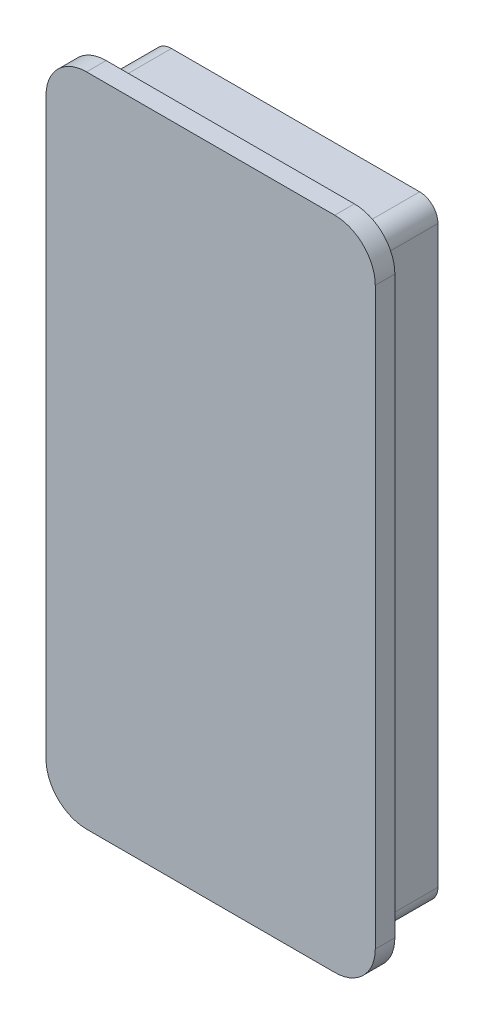
ISO-10303-21;
HEADER;
FILE_DESCRIPTION(('STEP AP214'),'2;1');
FILE_NAME('part.step','',(''),(''),'','','');
FILE_SCHEMA(('AUTOMOTIVE_DESIGN { 1 0 10303 214 1 1 1 1 }'));
ENDSEC;
DATA;
#1=APPLICATION_CONTEXT('core data for automotive mechanical design processes');
#2=APPLICATION_PROTOCOL_DEFINITION('international standard','automotive_design',2000,#1);
#3=PRODUCT_CONTEXT('',#1,'mechanical');
#4=PRODUCT('Part','Part','',(#3));
#5=PRODUCT_RELATED_PRODUCT_CATEGORY('part','',(#4));
#6=PRODUCT_DEFINITION_FORMATION('','',#4);
#7=PRODUCT_DEFINITION_CONTEXT('part definition',#1,'design');
#8=PRODUCT_DEFINITION('design','',#6,#7);
#9=PRODUCT_DEFINITION_SHAPE('','',#8);
#10=(LENGTH_UNIT() NAMED_UNIT(*) SI_UNIT(.MILLI.,.METRE.));
#11=(NAMED_UNIT(*) PLANE_ANGLE_UNIT() SI_UNIT($,.RADIAN.));
#12=(NAMED_UNIT(*) SI_UNIT($,.STERADIAN.) SOLID_ANGLE_UNIT());
#13=UNCERTAINTY_MEASURE_WITH_UNIT(LENGTH_MEASURE(1.E-05),#10,'distance_accuracy_value','');
#14=(GEOMETRIC_REPRESENTATION_CONTEXT(3) GLOBAL_UNCERTAINTY_ASSIGNED_CONTEXT((#13)) GLOBAL_UNIT_ASSIGNED_CONTEXT((#10,
#11,#12)) REPRESENTATION_CONTEXT('',''));
#15=CARTESIAN_POINT('',(0.,0.,0.));
#16=DIRECTION('',(0.,0.,1.));
#17=DIRECTION('',(1.,0.,0.));
#18=AXIS2_PLACEMENT_3D('',#15,#16,#17);
#19=CARTESIAN_POINT('',(-10.9,0.,405.1));
#20=DIRECTION('',(-1.,0.,0.));
#21=DIRECTION('',(0.,0.,1.));
#22=AXIS2_PLACEMENT_3D('',#19,#20,#21);
#23=PLANE('',#22);
#24=DIRECTION('',(0.,-1.,0.));
#25=VECTOR('',#24,1.);
#26=CARTESIAN_POINT('',(-10.9,0.,410.1));
#27=LINE('',#26,#25);
#28=CARTESIAN_POINT('',(-10.9,-3.,410.1));
#29=VERTEX_POINT('',#28);
#30=CARTESIAN_POINT('',(-10.9,-47.,410.1));
#31=VERTEX_POINT('',#30);
#32=EDGE_CURVE('E176',#29,#31,#27,.T.);
#33=ORIENTED_EDGE('',*,*,#32,.F.);
#34=DIRECTION('',(0.,0.,1.));
#35=VECTOR('',#34,1.);
#36=CARTESIAN_POINT('',(-10.9,-3.,405.1));
#37=LINE('',#36,#35);
#38=CARTESIAN_POINT('',(-10.9,-3.,405.1));
#39=VERTEX_POINT('',#38);
#40=EDGE_CURVE('E13',#39,#29,#37,.T.);
#41=ORIENTED_EDGE('',*,*,#40,.F.);
#42=DIRECTION('',(0.,-1.,0.));
#43=VECTOR('',#42,1.);
#44=CARTESIAN_POINT('',(-10.9,0.,405.1));
#45=LINE('',#44,#43);
#46=CARTESIAN_POINT('',(-10.9,-47.,405.1));
#47=VERTEX_POINT('',#46);
#48=EDGE_CURVE('E316',#39,#47,#45,.T.);
#49=ORIENTED_EDGE('',*,*,#48,.T.);
#50=DIRECTION('',(0.,0.,1.));
#51=VECTOR('',#50,1.);
#52=CARTESIAN_POINT('',(-10.9,-47.,405.1));
#53=LINE('',#52,#51);
#54=EDGE_CURVE('E206',#47,#31,#53,.T.);
#55=ORIENTED_EDGE('',*,*,#54,.T.);
#56=EDGE_LOOP('',(#33,#41,#49,#55));
#57=FACE_BOUND('',#56,.T.);
#58=ADVANCED_FACE('F49',(#57),#23,.T.);
#59=CARTESIAN_POINT('',(-9.5,-3.,405.1));
#60=DIRECTION('',(0.,0.,1.));
#61=DIRECTION('',(1.,0.,0.));
#62=AXIS2_PLACEMENT_3D('',#59,#60,#61);
#63=CYLINDRICAL_SURFACE('',#62,1.4);
#64=CARTESIAN_POINT('',(-9.5,-3.,410.1));
#65=DIRECTION('',(0.,0.,1.));
#66=DIRECTION('',(1.,0.,0.));
#67=AXIS2_PLACEMENT_3D('',#64,#65,#66);
#68=CIRCLE('',#67,1.4);
#69=CARTESIAN_POINT('',(-9.5,-1.6,410.1));
#70=VERTEX_POINT('',#69);
#71=EDGE_CURVE('E194',#70,#29,#68,.T.);
#72=ORIENTED_EDGE('',*,*,#71,.F.);
#73=DIRECTION('',(0.,0.,1.));
#74=VECTOR('',#73,1.);
#75=CARTESIAN_POINT('',(-9.5,-1.6,405.1));
#76=LINE('',#75,#74);
#77=CARTESIAN_POINT('',(-9.5,-1.6,405.1));
#78=VERTEX_POINT('',#77);
#79=EDGE_CURVE('E59',#78,#70,#76,.T.);
#80=ORIENTED_EDGE('',*,*,#79,.F.);
#81=CARTESIAN_POINT('',(-9.5,-3.,405.1));
#82=DIRECTION('',(0.,0.,1.));
#83=DIRECTION('',(1.,0.,0.));
#84=AXIS2_PLACEMENT_3D('',#81,#82,#83);
#85=CIRCLE('',#84,1.4);
#86=EDGE_CURVE('E153',#78,#39,#85,.T.);
#87=ORIENTED_EDGE('',*,*,#86,.T.);
#88=ORIENTED_EDGE('',*,*,#40,.T.);
#89=EDGE_LOOP('',(#72,#80,#87,#88));
#90=FACE_BOUND('',#89,.T.);
#91=ADVANCED_FACE('F339',(#90),#63,.T.);
#92=CARTESIAN_POINT('',(0.,-1.6,405.1));
#93=DIRECTION('',(0.,1.,0.));
#94=DIRECTION('',(-1.,0.,0.));
#95=AXIS2_PLACEMENT_3D('',#92,#93,#94);
#96=PLANE('',#95);
#97=DIRECTION('',(-1.,0.,0.));
#98=VECTOR('',#97,1.);
#99=CARTESIAN_POINT('',(0.,-1.6,410.1));
#100=LINE('',#99,#98);
#101=CARTESIAN_POINT('',(9.5,-1.6,410.1));
#102=VERTEX_POINT('',#101);
#103=EDGE_CURVE('E142',#102,#70,#100,.T.);
#104=ORIENTED_EDGE('',*,*,#103,.F.);
#105=DIRECTION('',(0.,0.,1.));
#106=VECTOR('',#105,1.);
#107=CARTESIAN_POINT('',(9.5,-1.6,405.1));
#108=LINE('',#107,#106);
#109=CARTESIAN_POINT('',(9.5,-1.6,405.1));
#110=VERTEX_POINT('',#109);
#111=EDGE_CURVE('E97',#110,#102,#108,.T.);
#112=ORIENTED_EDGE('',*,*,#111,.F.);
#113=DIRECTION('',(-1.,0.,0.));
#114=VECTOR('',#113,1.);
#115=CARTESIAN_POINT('',(0.,-1.6,405.1));
#116=LINE('',#115,#114);
#117=EDGE_CURVE('E139',#110,#78,#116,.T.);
#118=ORIENTED_EDGE('',*,*,#117,.T.);
#119=ORIENTED_EDGE('',*,*,#79,.T.);
#120=EDGE_LOOP('',(#104,#112,#118,#119));
#121=FACE_BOUND('',#120,.T.);
#122=ADVANCED_FACE('F138',(#121),#96,.T.);
#123=CARTESIAN_POINT('',(9.5,-3.,405.1));
#124=DIRECTION('',(0.,0.,1.));
#125=DIRECTION('',(1.,0.,0.));
#126=AXIS2_PLACEMENT_3D('',#123,#124,#125);
#127=CYLINDRICAL_SURFACE('',#126,1.4);
#128=CARTESIAN_POINT('',(9.5,-3.,410.1));
#129=DIRECTION('',(0.,0.,1.));
#130=DIRECTION('',(1.,0.,0.));
#131=AXIS2_PLACEMENT_3D('',#128,#129,#130);
#132=CIRCLE('',#131,1.4);
#133=CARTESIAN_POINT('',(10.9,-3.,410.1));
#134=VERTEX_POINT('',#133);
#135=EDGE_CURVE('E191',#134,#102,#132,.T.);
#136=ORIENTED_EDGE('',*,*,#135,.F.);
#137=DIRECTION('',(0.,0.,1.));
#138=VECTOR('',#137,1.);
#139=CARTESIAN_POINT('',(10.9,-3.,405.1));
#140=LINE('',#139,#138);
#141=CARTESIAN_POINT('',(10.9,-3.,405.1));
#142=VERTEX_POINT('',#141);
#143=EDGE_CURVE('E144',#142,#134,#140,.T.);
#144=ORIENTED_EDGE('',*,*,#143,.F.);
#145=CARTESIAN_POINT('',(9.5,-3.,405.1));
#146=DIRECTION('',(0.,0.,1.));
#147=DIRECTION('',(1.,0.,0.));
#148=AXIS2_PLACEMENT_3D('',#145,#146,#147);
#149=CIRCLE('',#148,1.4);
#150=EDGE_CURVE('E150',#142,#110,#149,.T.);
#151=ORIENTED_EDGE('',*,*,#150,.T.);
#152=ORIENTED_EDGE('',*,*,#111,.T.);
#153=EDGE_LOOP('',(#136,#144,#151,#152));
#154=FACE_BOUND('',#153,.T.);
#155=ADVANCED_FACE('F155',(#154),#127,.T.);
#156=CARTESIAN_POINT('',(10.9,0.,405.1));
#157=DIRECTION('',(1.,0.,0.));
#158=DIRECTION('',(0.,0.,-1.));
#159=AXIS2_PLACEMENT_3D('',#156,#157,#158);
#160=PLANE('',#159);
#161=DIRECTION('',(0.,1.,0.));
#162=VECTOR('',#161,1.);
#163=CARTESIAN_POINT('',(10.9,0.,410.1));
#164=LINE('',#163,#162);
#165=CARTESIAN_POINT('',(10.9,-47.,410.1));
#166=VERTEX_POINT('',#165);
#167=EDGE_CURVE('E188',#166,#134,#164,.T.);
#168=ORIENTED_EDGE('',*,*,#167,.F.);
#169=DIRECTION('',(0.,0.,1.));
#170=VECTOR('',#169,1.);
#171=CARTESIAN_POINT('',(10.9,-47.,405.1));
#172=LINE('',#171,#170);
#173=CARTESIAN_POINT('',(10.9,-47.,405.1));
#174=VERTEX_POINT('',#173);
#175=EDGE_CURVE('E200',#174,#166,#172,.T.);
#176=ORIENTED_EDGE('',*,*,#175,.F.);
#177=DIRECTION('',(0.,1.,0.));
#178=VECTOR('',#177,1.);
#179=CARTESIAN_POINT('',(10.9,0.,405.1));
#180=LINE('',#179,#178);
#181=EDGE_CURVE('E156',#174,#142,#180,.T.);
#182=ORIENTED_EDGE('',*,*,#181,.T.);
#183=ORIENTED_EDGE('',*,*,#143,.T.);
#184=EDGE_LOOP('',(#168,#176,#182,#183));
#185=FACE_BOUND('',#184,.T.);
#186=ADVANCED_FACE('F343',(#185),#160,.T.);
#187=CARTESIAN_POINT('',(9.5,-47.,405.1));
#188=DIRECTION('',(0.,0.,1.));
#189=DIRECTION('',(1.,0.,0.));
#190=AXIS2_PLACEMENT_3D('',#187,#188,#189);
#191=CYLINDRICAL_SURFACE('',#190,1.4);
#192=CARTESIAN_POINT('',(9.5,-47.,410.1));
#193=DIRECTION('',(0.,0.,1.));
#194=DIRECTION('',(1.,0.,0.));
#195=AXIS2_PLACEMENT_3D('',#192,#193,#194);
#196=CIRCLE('',#195,1.4);
#197=CARTESIAN_POINT('',(9.5,-48.4,410.1));
#198=VERTEX_POINT('',#197);
#199=EDGE_CURVE('E185',#198,#166,#196,.T.);
#200=ORIENTED_EDGE('',*,*,#199,.F.);
#201=DIRECTION('',(0.,0.,1.));
#202=VECTOR('',#201,1.);
#203=CARTESIAN_POINT('',(9.5,-48.4,405.1));
#204=LINE('',#203,#202);
#205=CARTESIAN_POINT('',(9.5,-48.4,405.1));
#206=VERTEX_POINT('',#205);
#207=EDGE_CURVE('E202',#206,#198,#204,.T.);
#208=ORIENTED_EDGE('',*,*,#207,.F.);
#209=CARTESIAN_POINT('',(9.5,-47.,405.1));
#210=DIRECTION('',(0.,0.,1.));
#211=DIRECTION('',(1.,0.,0.));
#212=AXIS2_PLACEMENT_3D('',#209,#210,#211);
#213=CIRCLE('',#212,1.4);
#214=EDGE_CURVE('E158',#206,#174,#213,.T.);
#215=ORIENTED_EDGE('',*,*,#214,.T.);
#216=ORIENTED_EDGE('',*,*,#175,.T.);
#217=EDGE_LOOP('',(#200,#208,#215,#216));
#218=FACE_BOUND('',#217,.T.);
#219=ADVANCED_FACE('F327',(#218),#191,.T.);
#220=CARTESIAN_POINT('',(0.,-48.4,405.1));
#221=DIRECTION('',(0.,-1.,0.));
#222=DIRECTION('',(0.,0.,-1.));
#223=AXIS2_PLACEMENT_3D('',#220,#221,#222);
#224=PLANE('',#223);
#225=DIRECTION('',(1.,0.,0.));
#226=VECTOR('',#225,1.);
#227=CARTESIAN_POINT('',(0.,-48.4,410.1));
#228=LINE('',#227,#226);
#229=CARTESIAN_POINT('',(-9.5,-48.4,410.1));
#230=VERTEX_POINT('',#229);
#231=EDGE_CURVE('E182',#230,#198,#228,.T.);
#232=ORIENTED_EDGE('',*,*,#231,.F.);
#233=DIRECTION('',(0.,0.,1.));
#234=VECTOR('',#233,1.);
#235=CARTESIAN_POINT('',(-9.5,-48.4,405.1));
#236=LINE('',#235,#234);
#237=CARTESIAN_POINT('',(-9.5,-48.4,405.1));
#238=VERTEX_POINT('',#237);
#239=EDGE_CURVE('E204',#238,#230,#236,.T.);
#240=ORIENTED_EDGE('',*,*,#239,.F.);
#241=DIRECTION('',(1.,0.,0.));
#242=VECTOR('',#241,1.);
#243=CARTESIAN_POINT('',(0.,-48.4,405.1));
#244=LINE('',#243,#242);
#245=EDGE_CURVE('E321',#238,#206,#244,.T.);
#246=ORIENTED_EDGE('',*,*,#245,.T.);
#247=ORIENTED_EDGE('',*,*,#207,.T.);
#248=EDGE_LOOP('',(#232,#240,#246,#247));
#249=FACE_BOUND('',#248,.T.);
#250=ADVANCED_FACE('F333',(#249),#224,.T.);
#251=CARTESIAN_POINT('',(0.,-3.1,405.1));
#252=DIRECTION('',(0.,-1.,0.));
#253=DIRECTION('',(0.,0.,-1.));
#254=AXIS2_PLACEMENT_3D('',#251,#252,#253);
#255=PLANE('',#254);
#256=DIRECTION('',(1.,0.,0.));
#257=VECTOR('',#256,1.);
#258=CARTESIAN_POINT('',(0.,-3.1,410.1));
#259=LINE('',#258,#257);
#260=CARTESIAN_POINT('',(-9.4,-3.1,410.1));
#261=VERTEX_POINT('',#260);
#262=CARTESIAN_POINT('',(9.39999999999999,-3.1,410.1));
#263=VERTEX_POINT('',#262);
#264=EDGE_CURVE('E163',#261,#263,#259,.T.);
#265=ORIENTED_EDGE('',*,*,#264,.F.);
#266=DIRECTION('',(0.,0.,1.));
#267=VECTOR('',#266,1.);
#268=CARTESIAN_POINT('',(-9.4,-3.1,405.1));
#269=LINE('',#268,#267);
#270=CARTESIAN_POINT('',(-9.4,-3.1,405.1));
#271=VERTEX_POINT('',#270);
#272=EDGE_CURVE('E208',#271,#261,#269,.T.);
#273=ORIENTED_EDGE('',*,*,#272,.F.);
#274=DIRECTION('',(1.,0.,0.));
#275=VECTOR('',#274,1.);
#276=CARTESIAN_POINT('',(0.,-3.1,405.1));
#277=LINE('',#276,#275);
#278=CARTESIAN_POINT('',(9.39999999999999,-3.1,405.1));
#279=VERTEX_POINT('',#278);
#280=EDGE_CURVE('E196',#271,#279,#277,.T.);
#281=ORIENTED_EDGE('',*,*,#280,.T.);
#282=DIRECTION('',(0.,0.,1.));
#283=VECTOR('',#282,1.);
#284=CARTESIAN_POINT('',(9.39999999999999,-3.1,405.1));
#285=LINE('',#284,#283);
#286=EDGE_CURVE('E53',#279,#263,#285,.T.);
#287=ORIENTED_EDGE('',*,*,#286,.T.);
#288=EDGE_LOOP('',(#265,#273,#281,#287));
#289=FACE_BOUND('',#288,.T.);
#290=ADVANCED_FACE('F51',(#289),#255,.T.);
#291=CARTESIAN_POINT('',(-9.4,0.,405.1));
#292=DIRECTION('',(-1.,0.,0.));
#293=DIRECTION('',(0.,-1.,0.));
#294=AXIS2_PLACEMENT_3D('',#291,#292,#293);
#295=PLANE('',#294);
#296=DIRECTION('',(0.,-1.,0.));
#297=VECTOR('',#296,1.);
#298=CARTESIAN_POINT('',(-9.4,0.,410.1));
#299=LINE('',#298,#297);
#300=CARTESIAN_POINT('',(-9.4,-46.9,410.1));
#301=VERTEX_POINT('',#300);
#302=EDGE_CURVE('E173',#261,#301,#299,.T.);
#303=ORIENTED_EDGE('',*,*,#302,.T.);
#304=DIRECTION('',(0.,0.,1.));
#305=VECTOR('',#304,1.);
#306=CARTESIAN_POINT('',(-9.4,-46.9,405.1));
#307=LINE('',#306,#305);
#308=CARTESIAN_POINT('',(-9.4,-46.9,405.1));
#309=VERTEX_POINT('',#308);
#310=EDGE_CURVE('E211',#309,#301,#307,.T.);
#311=ORIENTED_EDGE('',*,*,#310,.F.);
#312=DIRECTION('',(0.,-1.,0.));
#313=VECTOR('',#312,1.);
#314=CARTESIAN_POINT('',(-9.4,0.,405.1));
#315=LINE('',#314,#313);
#316=EDGE_CURVE('E314',#271,#309,#315,.T.);
#317=ORIENTED_EDGE('',*,*,#316,.F.);
#318=ORIENTED_EDGE('',*,*,#272,.T.);
#319=EDGE_LOOP('',(#303,#311,#317,#318));
#320=FACE_BOUND('',#319,.T.);
#321=ADVANCED_FACE('F361',(#320),#295,.F.);
#322=CARTESIAN_POINT('',(0.,-46.9,405.1));
#323=DIRECTION('',(0.,-1.,0.));
#324=DIRECTION('',(0.,0.,-1.));
#325=AXIS2_PLACEMENT_3D('',#322,#323,#324);
#326=PLANE('',#325);
#327=DIRECTION('',(1.,0.,0.));
#328=VECTOR('',#327,1.);
#329=CARTESIAN_POINT('',(0.,-46.9,410.1));
#330=LINE('',#329,#328);
#331=CARTESIAN_POINT('',(9.4,-46.9,410.1));
#332=VERTEX_POINT('',#331);
#333=EDGE_CURVE('E170',#301,#332,#330,.T.);
#334=ORIENTED_EDGE('',*,*,#333,.T.);
#335=DIRECTION('',(0.,0.,1.));
#336=VECTOR('',#335,1.);
#337=CARTESIAN_POINT('',(9.4,-46.9,405.1));
#338=LINE('',#337,#336);
#339=CARTESIAN_POINT('',(9.4,-46.9,405.1));
#340=VERTEX_POINT('',#339);
#341=EDGE_CURVE('E213',#340,#332,#338,.T.);
#342=ORIENTED_EDGE('',*,*,#341,.F.);
#343=DIRECTION('',(1.,0.,0.));
#344=VECTOR('',#343,1.);
#345=CARTESIAN_POINT('',(0.,-46.9,405.1));
#346=LINE('',#345,#344);
#347=EDGE_CURVE('E312',#309,#340,#346,.T.);
#348=ORIENTED_EDGE('',*,*,#347,.F.);
#349=ORIENTED_EDGE('',*,*,#310,.T.);
#350=EDGE_LOOP('',(#334,#342,#348,#349));
#351=FACE_BOUND('',#350,.T.);
#352=ADVANCED_FACE('F364',(#351),#326,.F.);
#353=CARTESIAN_POINT('',(9.39999999999999,0.,405.1));
#354=DIRECTION('',(-1.,0.,0.));
#355=DIRECTION('',(0.,-1.,0.));
#356=AXIS2_PLACEMENT_3D('',#353,#354,#355);
#357=PLANE('',#356);
#358=DIRECTION('',(0.,-1.,0.));
#359=VECTOR('',#358,1.);
#360=CARTESIAN_POINT('',(9.39999999999999,0.,410.1));
#361=LINE('',#360,#359);
#362=EDGE_CURVE('E166',#263,#332,#361,.T.);
#363=ORIENTED_EDGE('',*,*,#362,.F.);
#364=ORIENTED_EDGE('',*,*,#286,.F.);
#365=DIRECTION('',(0.,-1.,0.));
#366=VECTOR('',#365,1.);
#367=CARTESIAN_POINT('',(9.39999999999999,0.,405.1));
#368=LINE('',#367,#366);
#369=EDGE_CURVE('E310',#279,#340,#368,.T.);
#370=ORIENTED_EDGE('',*,*,#369,.T.);
#371=ORIENTED_EDGE('',*,*,#341,.T.);
#372=EDGE_LOOP('',(#363,#364,#370,#371));
#373=FACE_BOUND('',#372,.T.);
#374=ADVANCED_FACE('F222',(#373),#357,.T.);
#375=CARTESIAN_POINT('',(-9.5,-47.,405.1));
#376=DIRECTION('',(0.,0.,1.));
#377=DIRECTION('',(1.,0.,0.));
#378=AXIS2_PLACEMENT_3D('',#375,#376,#377);
#379=CYLINDRICAL_SURFACE('',#378,1.4);
#380=CARTESIAN_POINT('',(-9.5,-47.,410.1));
#381=DIRECTION('',(0.,0.,1.));
#382=DIRECTION('',(1.,0.,0.));
#383=AXIS2_PLACEMENT_3D('',#380,#381,#382);
#384=CIRCLE('',#383,1.4);
#385=EDGE_CURVE('E179',#31,#230,#384,.T.);
#386=ORIENTED_EDGE('',*,*,#385,.F.);
#387=ORIENTED_EDGE('',*,*,#54,.F.);
#388=CARTESIAN_POINT('',(-9.5,-47.,405.1));
#389=DIRECTION('',(0.,0.,1.));
#390=DIRECTION('',(1.,0.,0.));
#391=AXIS2_PLACEMENT_3D('',#388,#389,#390);
#392=CIRCLE('',#391,1.4);
#393=EDGE_CURVE('E318',#47,#238,#392,.T.);
#394=ORIENTED_EDGE('',*,*,#393,.T.);
#395=ORIENTED_EDGE('',*,*,#239,.T.);
#396=EDGE_LOOP('',(#386,#387,#394,#395));
#397=FACE_BOUND('',#396,.T.);
#398=ADVANCED_FACE('F336',(#397),#379,.T.);
#399=CARTESIAN_POINT('',(0.,0.,405.1));
#400=DIRECTION('',(0.,0.,1.));
#401=DIRECTION('',(1.,0.,0.));
#402=AXIS2_PLACEMENT_3D('',#399,#400,#401);
#403=PLANE('',#402);
#404=ORIENTED_EDGE('',*,*,#280,.F.);
#405=ORIENTED_EDGE('',*,*,#316,.T.);
#406=ORIENTED_EDGE('',*,*,#347,.T.);
#407=ORIENTED_EDGE('',*,*,#369,.F.);
#408=EDGE_LOOP('',(#404,#405,#406,#407));
#409=FACE_BOUND('',#408,.T.);
#410=ORIENTED_EDGE('',*,*,#48,.F.);
#411=ORIENTED_EDGE('',*,*,#86,.F.);
#412=ORIENTED_EDGE('',*,*,#117,.F.);
#413=ORIENTED_EDGE('',*,*,#150,.F.);
#414=ORIENTED_EDGE('',*,*,#181,.F.);
#415=ORIENTED_EDGE('',*,*,#214,.F.);
#416=ORIENTED_EDGE('',*,*,#245,.F.);
#417=ORIENTED_EDGE('',*,*,#393,.F.);
#418=EDGE_LOOP('',(#410,#411,#412,#413,#414,#415,#416,#417));
#419=FACE_BOUND('',#418,.T.);
#420=ADVANCED_FACE('F148',(#409,#419),#403,.F.);
#421=CARTESIAN_POINT('',(0.,0.,411.6));
#422=DIRECTION('',(0.,0.,1.));
#423=DIRECTION('',(1.,0.,0.));
#424=AXIS2_PLACEMENT_3D('',#421,#422,#423);
#425=PLANE('',#424);
#426=DIRECTION('',(0.,-1.,0.));
#427=VECTOR('',#426,1.);
#428=CARTESIAN_POINT('',(-12.6,0.,411.6));
#429=LINE('',#428,#427);
#430=CARTESIAN_POINT('',(-12.6,-3.,411.6));
#431=VERTEX_POINT('',#430);
#432=CARTESIAN_POINT('',(-12.6,-47.,411.6));
#433=VERTEX_POINT('',#432);
#434=EDGE_CURVE('E290',#431,#433,#429,.T.);
#435=ORIENTED_EDGE('',*,*,#434,.T.);
#436=CARTESIAN_POINT('',(-9.5,-47.,411.6));
#437=DIRECTION('',(0.,0.,1.));
#438=DIRECTION('',(1.,0.,0.));
#439=AXIS2_PLACEMENT_3D('',#436,#437,#438);
#440=CIRCLE('',#439,3.1);
#441=CARTESIAN_POINT('',(-9.5,-50.1,411.6));
#442=VERTEX_POINT('',#441);
#443=EDGE_CURVE('E280',#433,#442,#440,.T.);
#444=ORIENTED_EDGE('',*,*,#443,.T.);
#445=DIRECTION('',(1.,0.,0.));
#446=VECTOR('',#445,1.);
#447=CARTESIAN_POINT('',(0.,-50.1,411.6));
#448=LINE('',#447,#446);
#449=CARTESIAN_POINT('',(9.5,-50.1,411.6));
#450=VERTEX_POINT('',#449);
#451=EDGE_CURVE('E289',#442,#450,#448,.T.);
#452=ORIENTED_EDGE('',*,*,#451,.T.);
#453=CARTESIAN_POINT('',(9.5,-47.,411.6));
#454=DIRECTION('',(0.,0.,1.));
#455=DIRECTION('',(1.,0.,0.));
#456=AXIS2_PLACEMENT_3D('',#453,#454,#455);
#457=CIRCLE('',#456,3.1);
#458=CARTESIAN_POINT('',(12.6,-47.,411.6));
#459=VERTEX_POINT('',#458);
#460=EDGE_CURVE('E563',#450,#459,#457,.T.);
#461=ORIENTED_EDGE('',*,*,#460,.T.);
#462=DIRECTION('',(0.,1.,0.));
#463=VECTOR('',#462,1.);
#464=CARTESIAN_POINT('',(12.6,0.,411.6));
#465=LINE('',#464,#463);
#466=CARTESIAN_POINT('',(12.6,-3.,411.6));
#467=VERTEX_POINT('',#466);
#468=EDGE_CURVE('E590',#459,#467,#465,.T.);
#469=ORIENTED_EDGE('',*,*,#468,.T.);
#470=CARTESIAN_POINT('',(9.5,-3.,411.6));
#471=DIRECTION('',(0.,0.,1.));
#472=DIRECTION('',(1.,0.,0.));
#473=AXIS2_PLACEMENT_3D('',#470,#471,#472);
#474=CIRCLE('',#473,3.1);
#475=CARTESIAN_POINT('',(9.5,0.0999999999999994,411.6));
#476=VERTEX_POINT('',#475);
#477=EDGE_CURVE('E592',#467,#476,#474,.T.);
#478=ORIENTED_EDGE('',*,*,#477,.T.);
#479=DIRECTION('',(-1.,0.,0.));
#480=VECTOR('',#479,1.);
#481=CARTESIAN_POINT('',(0.,0.0999999999999997,411.6));
#482=LINE('',#481,#480);
#483=CARTESIAN_POINT('',(-9.5,0.1,411.6));
#484=VERTEX_POINT('',#483);
#485=EDGE_CURVE('E594',#476,#484,#482,.T.);
#486=ORIENTED_EDGE('',*,*,#485,.T.);
#487=CARTESIAN_POINT('',(-9.5,-3.,411.6));
#488=DIRECTION('',(0.,0.,1.));
#489=DIRECTION('',(1.,0.,0.));
#490=AXIS2_PLACEMENT_3D('',#487,#488,#489);
#491=CIRCLE('',#490,3.1);
#492=EDGE_CURVE('E295',#484,#431,#491,.T.);
#493=ORIENTED_EDGE('',*,*,#492,.T.);
#494=EDGE_LOOP('',(#435,#444,#452,#461,#469,#478,#486,#493));
#495=FACE_BOUND('',#494,.T.);
#496=ADVANCED_FACE('F293',(#495),#425,.T.);
#497=CARTESIAN_POINT('',(0.,0.,410.1));
#498=DIRECTION('',(0.,0.,1.));
#499=DIRECTION('',(1.,0.,0.));
#500=AXIS2_PLACEMENT_3D('',#497,#498,#499);
#501=PLANE('',#500);
#502=ORIENTED_EDGE('',*,*,#71,.T.);
#503=ORIENTED_EDGE('',*,*,#32,.T.);
#504=ORIENTED_EDGE('',*,*,#385,.T.);
#505=ORIENTED_EDGE('',*,*,#231,.T.);
#506=ORIENTED_EDGE('',*,*,#199,.T.);
#507=ORIENTED_EDGE('',*,*,#167,.T.);
#508=ORIENTED_EDGE('',*,*,#135,.T.);
#509=ORIENTED_EDGE('',*,*,#103,.T.);
#510=EDGE_LOOP('',(#502,#503,#504,#505,#506,#507,#508,#509));
#511=FACE_BOUND('',#510,.T.);
#512=DIRECTION('',(0.,-1.,0.));
#513=VECTOR('',#512,1.);
#514=CARTESIAN_POINT('',(-12.6,0.,410.1));
#515=LINE('',#514,#513);
#516=CARTESIAN_POINT('',(-12.6,-3.,410.1));
#517=VERTEX_POINT('',#516);
#518=CARTESIAN_POINT('',(-12.6,-47.,410.1));
#519=VERTEX_POINT('',#518);
#520=EDGE_CURVE('E303',#517,#519,#515,.T.);
#521=ORIENTED_EDGE('',*,*,#520,.F.);
#522=CARTESIAN_POINT('',(-9.5,-3.,410.1));
#523=DIRECTION('',(0.,0.,1.));
#524=DIRECTION('',(1.,0.,0.));
#525=AXIS2_PLACEMENT_3D('',#522,#523,#524);
#526=CIRCLE('',#525,3.1);
#527=CARTESIAN_POINT('',(-9.5,0.1,410.1));
#528=VERTEX_POINT('',#527);
#529=EDGE_CURVE('E299',#528,#517,#526,.T.);
#530=ORIENTED_EDGE('',*,*,#529,.F.);
#531=DIRECTION('',(-1.,0.,0.));
#532=VECTOR('',#531,1.);
#533=CARTESIAN_POINT('',(0.,0.0999999999999997,410.1));
#534=LINE('',#533,#532);
#535=CARTESIAN_POINT('',(9.5,0.0999999999999994,410.1));
#536=VERTEX_POINT('',#535);
#537=EDGE_CURVE('E574',#536,#528,#534,.T.);
#538=ORIENTED_EDGE('',*,*,#537,.F.);
#539=CARTESIAN_POINT('',(9.5,-3.,410.1));
#540=DIRECTION('',(0.,0.,1.));
#541=DIRECTION('',(1.,0.,0.));
#542=AXIS2_PLACEMENT_3D('',#539,#540,#541);
#543=CIRCLE('',#542,3.1);
#544=CARTESIAN_POINT('',(12.6,-3.,410.1));
#545=VERTEX_POINT('',#544);
#546=EDGE_CURVE('E569',#545,#536,#543,.T.);
#547=ORIENTED_EDGE('',*,*,#546,.F.);
#548=DIRECTION('',(0.,1.,0.));
#549=VECTOR('',#548,1.);
#550=CARTESIAN_POINT('',(12.6,0.,410.1));
#551=LINE('',#550,#549);
#552=CARTESIAN_POINT('',(12.6,-47.,410.1));
#553=VERTEX_POINT('',#552);
#554=EDGE_CURVE('E567',#553,#545,#551,.T.);
#555=ORIENTED_EDGE('',*,*,#554,.F.);
#556=CARTESIAN_POINT('',(9.5,-47.,410.1));
#557=DIRECTION('',(0.,0.,1.));
#558=DIRECTION('',(1.,0.,0.));
#559=AXIS2_PLACEMENT_3D('',#556,#557,#558);
#560=CIRCLE('',#559,3.1);
#561=CARTESIAN_POINT('',(9.5,-50.1,410.1));
#562=VERTEX_POINT('',#561);
#563=EDGE_CURVE('E558',#562,#553,#560,.T.);
#564=ORIENTED_EDGE('',*,*,#563,.F.);
#565=DIRECTION('',(1.,0.,0.));
#566=VECTOR('',#565,1.);
#567=CARTESIAN_POINT('',(0.,-50.1,410.1));
#568=LINE('',#567,#566);
#569=CARTESIAN_POINT('',(-9.5,-50.1,410.1));
#570=VERTEX_POINT('',#569);
#571=EDGE_CURVE('E554',#570,#562,#568,.T.);
#572=ORIENTED_EDGE('',*,*,#571,.F.);
#573=CARTESIAN_POINT('',(-9.5,-47.,410.1));
#574=DIRECTION('',(0.,0.,1.));
#575=DIRECTION('',(1.,0.,0.));
#576=AXIS2_PLACEMENT_3D('',#573,#574,#575);
#577=CIRCLE('',#576,3.1);
#578=EDGE_CURVE('E559',#519,#570,#577,.T.);
#579=ORIENTED_EDGE('',*,*,#578,.F.);
#580=EDGE_LOOP('',(#521,#530,#538,#547,#555,#564,#572,#579));
#581=FACE_BOUND('',#580,.T.);
#582=ADVANCED_FACE('F340',(#511,#581),#501,.F.);
#583=CARTESIAN_POINT('',(-12.6,0.,411.6));
#584=DIRECTION('',(1.,0.,0.));
#585=DIRECTION('',(0.,0.,-1.));
#586=AXIS2_PLACEMENT_3D('',#583,#584,#585);
#587=PLANE('',#586);
#588=ORIENTED_EDGE('',*,*,#520,.T.);
#589=DIRECTION('',(0.,0.,-1.));
#590=VECTOR('',#589,1.);
#591=CARTESIAN_POINT('',(-12.6,-47.,411.6));
#592=LINE('',#591,#590);
#593=EDGE_CURVE('E167',#433,#519,#592,.T.);
#594=ORIENTED_EDGE('',*,*,#593,.F.);
#595=ORIENTED_EDGE('',*,*,#434,.F.);
#596=DIRECTION('',(0.,0.,-1.));
#597=VECTOR('',#596,1.);
#598=CARTESIAN_POINT('',(-12.6,-3.,411.6));
#599=LINE('',#598,#597);
#600=EDGE_CURVE('E577',#431,#517,#599,.T.);
#601=ORIENTED_EDGE('',*,*,#600,.T.);
#602=EDGE_LOOP('',(#588,#594,#595,#601));
#603=FACE_BOUND('',#602,.T.);
#604=ADVANCED_FACE('F301',(#603),#587,.F.);
#605=CARTESIAN_POINT('',(-9.5,-3.,411.6));
#606=DIRECTION('',(0.,0.,-1.));
#607=DIRECTION('',(-1.,0.,0.));
#608=AXIS2_PLACEMENT_3D('',#605,#606,#607);
#609=CYLINDRICAL_SURFACE('',#608,3.1);
#610=ORIENTED_EDGE('',*,*,#529,.T.);
#611=ORIENTED_EDGE('',*,*,#600,.F.);
#612=ORIENTED_EDGE('',*,*,#492,.F.);
#613=DIRECTION('',(0.,0.,-1.));
#614=VECTOR('',#613,1.);
#615=CARTESIAN_POINT('',(-9.5,0.1,411.6));
#616=LINE('',#615,#614);
#617=EDGE_CURVE('E579',#484,#528,#616,.T.);
#618=ORIENTED_EDGE('',*,*,#617,.T.);
#619=EDGE_LOOP('',(#610,#611,#612,#618));
#620=FACE_BOUND('',#619,.T.);
#621=ADVANCED_FACE('F474',(#620),#609,.T.);
#622=CARTESIAN_POINT('',(0.,0.0999999999999997,411.6));
#623=DIRECTION('',(0.,-1.,0.));
#624=DIRECTION('',(1.,0.,0.));
#625=AXIS2_PLACEMENT_3D('',#622,#623,#624);
#626=PLANE('',#625);
#627=ORIENTED_EDGE('',*,*,#537,.T.);
#628=ORIENTED_EDGE('',*,*,#617,.F.);
#629=ORIENTED_EDGE('',*,*,#485,.F.);
#630=DIRECTION('',(0.,0.,-1.));
#631=VECTOR('',#630,1.);
#632=CARTESIAN_POINT('',(9.5,0.0999999999999994,411.6));
#633=LINE('',#632,#631);
#634=EDGE_CURVE('E582',#476,#536,#633,.T.);
#635=ORIENTED_EDGE('',*,*,#634,.T.);
#636=EDGE_LOOP('',(#627,#628,#629,#635));
#637=FACE_BOUND('',#636,.T.);
#638=ADVANCED_FACE('F482',(#637),#626,.F.);
#639=CARTESIAN_POINT('',(9.5,-3.,411.6));
#640=DIRECTION('',(0.,0.,-1.));
#641=DIRECTION('',(-1.,0.,0.));
#642=AXIS2_PLACEMENT_3D('',#639,#640,#641);
#643=CYLINDRICAL_SURFACE('',#642,3.1);
#644=ORIENTED_EDGE('',*,*,#546,.T.);
#645=ORIENTED_EDGE('',*,*,#634,.F.);
#646=ORIENTED_EDGE('',*,*,#477,.F.);
#647=DIRECTION('',(0.,0.,-1.));
#648=VECTOR('',#647,1.);
#649=CARTESIAN_POINT('',(12.6,-3.,411.6));
#650=LINE('',#649,#648);
#651=EDGE_CURVE('E585',#467,#545,#650,.T.);
#652=ORIENTED_EDGE('',*,*,#651,.T.);
#653=EDGE_LOOP('',(#644,#645,#646,#652));
#654=FACE_BOUND('',#653,.T.);
#655=ADVANCED_FACE('F492',(#654),#643,.T.);
#656=CARTESIAN_POINT('',(12.6,0.,411.6));
#657=DIRECTION('',(-1.,0.,0.));
#658=DIRECTION('',(0.,0.,1.));
#659=AXIS2_PLACEMENT_3D('',#656,#657,#658);
#660=PLANE('',#659);
#661=ORIENTED_EDGE('',*,*,#554,.T.);
#662=ORIENTED_EDGE('',*,*,#651,.F.);
#663=ORIENTED_EDGE('',*,*,#468,.F.);
#664=DIRECTION('',(0.,0.,-1.));
#665=VECTOR('',#664,1.);
#666=CARTESIAN_POINT('',(12.6,-47.,411.6));
#667=LINE('',#666,#665);
#668=EDGE_CURVE('E564',#459,#553,#667,.T.);
#669=ORIENTED_EDGE('',*,*,#668,.T.);
#670=EDGE_LOOP('',(#661,#662,#663,#669));
#671=FACE_BOUND('',#670,.T.);
#672=ADVANCED_FACE('F502',(#671),#660,.F.);
#673=CARTESIAN_POINT('',(9.5,-47.,411.6));
#674=DIRECTION('',(0.,0.,-1.));
#675=DIRECTION('',(-1.,0.,0.));
#676=AXIS2_PLACEMENT_3D('',#673,#674,#675);
#677=CYLINDRICAL_SURFACE('',#676,3.1);
#678=ORIENTED_EDGE('',*,*,#563,.T.);
#679=ORIENTED_EDGE('',*,*,#668,.F.);
#680=ORIENTED_EDGE('',*,*,#460,.F.);
#681=DIRECTION('',(0.,0.,-1.));
#682=VECTOR('',#681,1.);
#683=CARTESIAN_POINT('',(9.5,-50.1,411.6));
#684=LINE('',#683,#682);
#685=EDGE_CURVE('E305',#450,#562,#684,.T.);
#686=ORIENTED_EDGE('',*,*,#685,.T.);
#687=EDGE_LOOP('',(#678,#679,#680,#686));
#688=FACE_BOUND('',#687,.T.);
#689=ADVANCED_FACE('F512',(#688),#677,.T.);
#690=CARTESIAN_POINT('',(0.,-50.1,411.6));
#691=DIRECTION('',(0.,1.,0.));
#692=DIRECTION('',(0.,0.,1.));
#693=AXIS2_PLACEMENT_3D('',#690,#691,#692);
#694=PLANE('',#693);
#695=ORIENTED_EDGE('',*,*,#571,.T.);
#696=ORIENTED_EDGE('',*,*,#685,.F.);
#697=ORIENTED_EDGE('',*,*,#451,.F.);
#698=DIRECTION('',(0.,0.,-1.));
#699=VECTOR('',#698,1.);
#700=CARTESIAN_POINT('',(-9.5,-50.1,411.6));
#701=LINE('',#700,#699);
#702=EDGE_CURVE('E286',#442,#570,#701,.T.);
#703=ORIENTED_EDGE('',*,*,#702,.T.);
#704=EDGE_LOOP('',(#695,#696,#697,#703));
#705=FACE_BOUND('',#704,.T.);
#706=ADVANCED_FACE('F522',(#705),#694,.F.);
#707=CARTESIAN_POINT('',(-9.5,-47.,411.6));
#708=DIRECTION('',(0.,0.,-1.));
#709=DIRECTION('',(-1.,0.,0.));
#710=AXIS2_PLACEMENT_3D('',#707,#708,#709);
#711=CYLINDRICAL_SURFACE('',#710,3.1);
#712=ORIENTED_EDGE('',*,*,#578,.T.);
#713=ORIENTED_EDGE('',*,*,#702,.F.);
#714=ORIENTED_EDGE('',*,*,#443,.F.);
#715=ORIENTED_EDGE('',*,*,#593,.T.);
#716=EDGE_LOOP('',(#712,#713,#714,#715));
#717=FACE_BOUND('',#716,.T.);
#718=ADVANCED_FACE('F282',(#717),#711,.T.);
#719=ORIENTED_EDGE('',*,*,#302,.F.);
#720=ORIENTED_EDGE('',*,*,#264,.T.);
#721=ORIENTED_EDGE('',*,*,#362,.T.);
#722=ORIENTED_EDGE('',*,*,#333,.F.);
#723=EDGE_LOOP('',(#719,#720,#721,#722));
#724=FACE_BOUND('',#723,.T.);
#725=ADVANCED_FACE('F225',(#724),#501,.F.);
#726=CLOSED_SHELL('',(#58,#91,#122,#155,#186,#219,#250,#290,#321,#352,#374,#398,#420,#496,#582,
#604,#621,#638,#655,#672,#689,#706,#718,#725));
#727=MANIFOLD_SOLID_BREP('B2',#726);
#728=ADVANCED_BREP_SHAPE_REPRESENTATION('',(#18,#727),#14);
#729=SHAPE_DEFINITION_REPRESENTATION(#9,#728);
ENDSEC;
END-ISO-10303-21;
